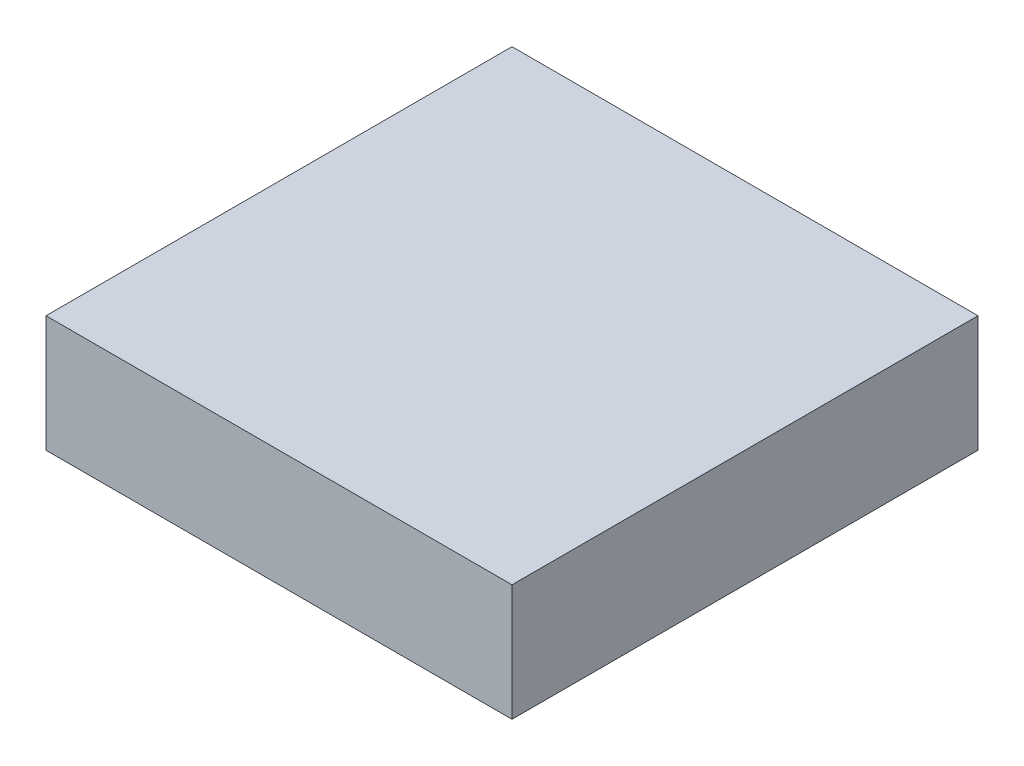
ISO-10303-21;
HEADER;
FILE_DESCRIPTION(('STEP AP214'),'2;1');
FILE_NAME('part.step','',(''),(''),'','','');
FILE_SCHEMA(('AUTOMOTIVE_DESIGN { 1 0 10303 214 1 1 1 1 }'));
ENDSEC;
DATA;
#1=APPLICATION_CONTEXT('core data for automotive mechanical design processes');
#2=APPLICATION_PROTOCOL_DEFINITION('international standard','automotive_design',2000,#1);
#3=PRODUCT_CONTEXT('',#1,'mechanical');
#4=PRODUCT('Part','Part','',(#3));
#5=PRODUCT_RELATED_PRODUCT_CATEGORY('part','',(#4));
#6=PRODUCT_DEFINITION_FORMATION('','',#4);
#7=PRODUCT_DEFINITION_CONTEXT('part definition',#1,'design');
#8=PRODUCT_DEFINITION('design','',#6,#7);
#9=PRODUCT_DEFINITION_SHAPE('','',#8);
#10=(LENGTH_UNIT() NAMED_UNIT(*) SI_UNIT(.MILLI.,.METRE.));
#11=(NAMED_UNIT(*) PLANE_ANGLE_UNIT() SI_UNIT($,.RADIAN.));
#12=(NAMED_UNIT(*) SI_UNIT($,.STERADIAN.) SOLID_ANGLE_UNIT());
#13=UNCERTAINTY_MEASURE_WITH_UNIT(LENGTH_MEASURE(1.E-05),#10,'distance_accuracy_value','');
#14=(GEOMETRIC_REPRESENTATION_CONTEXT(3) GLOBAL_UNCERTAINTY_ASSIGNED_CONTEXT((#13)) GLOBAL_UNIT_ASSIGNED_CONTEXT((#10,
#11,#12)) REPRESENTATION_CONTEXT('',''));
#15=CARTESIAN_POINT('',(0.,0.,0.));
#16=DIRECTION('',(0.,0.,1.));
#17=DIRECTION('',(1.,0.,0.));
#18=AXIS2_PLACEMENT_3D('',#15,#16,#17);
#19=CARTESIAN_POINT('',(-6096.,-3048.,-6096.));
#20=DIRECTION('',(-1.,0.,0.));
#21=DIRECTION('',(0.,0.,1.));
#22=AXIS2_PLACEMENT_3D('',#19,#20,#21);
#23=PLANE('',#22);
#24=DIRECTION('',(0.,0.,1.));
#25=VECTOR('',#24,1.);
#26=CARTESIAN_POINT('',(-6096.,0.,-6096.));
#27=LINE('',#26,#25);
#28=CARTESIAN_POINT('',(-6096.,0.,-6096.));
#29=VERTEX_POINT('',#28);
#30=CARTESIAN_POINT('',(-6096.,0.,6096.));
#31=VERTEX_POINT('',#30);
#32=EDGE_CURVE('E101',#29,#31,#27,.T.);
#33=ORIENTED_EDGE('',*,*,#32,.F.);
#34=DIRECTION('',(0.,1.,0.));
#35=VECTOR('',#34,1.);
#36=CARTESIAN_POINT('',(-6096.,-3048.,-6096.));
#37=LINE('',#36,#35);
#38=CARTESIAN_POINT('',(-6096.,-3048.,-6096.));
#39=VERTEX_POINT('',#38);
#40=EDGE_CURVE('E11',#39,#29,#37,.T.);
#41=ORIENTED_EDGE('',*,*,#40,.F.);
#42=DIRECTION('',(0.,0.,1.));
#43=VECTOR('',#42,1.);
#44=CARTESIAN_POINT('',(-6096.,-3048.,-6096.));
#45=LINE('',#44,#43);
#46=CARTESIAN_POINT('',(-6096.,-3048.,6096.));
#47=VERTEX_POINT('',#46);
#48=EDGE_CURVE('E95',#39,#47,#45,.T.);
#49=ORIENTED_EDGE('',*,*,#48,.T.);
#50=DIRECTION('',(0.,1.,0.));
#51=VECTOR('',#50,1.);
#52=CARTESIAN_POINT('',(-6096.,-3048.,6096.));
#53=LINE('',#52,#51);
#54=EDGE_CURVE('E40',#47,#31,#53,.T.);
#55=ORIENTED_EDGE('',*,*,#54,.T.);
#56=EDGE_LOOP('',(#33,#41,#49,#55));
#57=FACE_BOUND('',#56,.T.);
#58=ADVANCED_FACE('F37',(#57),#23,.T.);
#59=CARTESIAN_POINT('',(-6096.,-3048.,-6096.));
#60=DIRECTION('',(0.,0.,-1.));
#61=DIRECTION('',(-1.,0.,0.));
#62=AXIS2_PLACEMENT_3D('',#59,#60,#61);
#63=PLANE('',#62);
#64=DIRECTION('',(-1.,0.,0.));
#65=VECTOR('',#64,1.);
#66=CARTESIAN_POINT('',(-6096.,0.,-6096.));
#67=LINE('',#66,#65);
#68=CARTESIAN_POINT('',(6096.,0.,-6096.));
#69=VERTEX_POINT('',#68);
#70=EDGE_CURVE('E97',#69,#29,#67,.T.);
#71=ORIENTED_EDGE('',*,*,#70,.F.);
#72=DIRECTION('',(0.,1.,0.));
#73=VECTOR('',#72,1.);
#74=CARTESIAN_POINT('',(6096.,-3048.,-6096.));
#75=LINE('',#74,#73);
#76=CARTESIAN_POINT('',(6096.,-3048.,-6096.));
#77=VERTEX_POINT('',#76);
#78=EDGE_CURVE('E46',#77,#69,#75,.T.);
#79=ORIENTED_EDGE('',*,*,#78,.F.);
#80=DIRECTION('',(-1.,0.,0.));
#81=VECTOR('',#80,1.);
#82=CARTESIAN_POINT('',(-6096.,-3048.,-6096.));
#83=LINE('',#82,#81);
#84=EDGE_CURVE('E92',#77,#39,#83,.T.);
#85=ORIENTED_EDGE('',*,*,#84,.T.);
#86=ORIENTED_EDGE('',*,*,#40,.T.);
#87=EDGE_LOOP('',(#71,#79,#85,#86));
#88=FACE_BOUND('',#87,.T.);
#89=ADVANCED_FACE('F111',(#88),#63,.T.);
#90=CARTESIAN_POINT('',(6096.,-3048.,-6096.));
#91=DIRECTION('',(1.,0.,0.));
#92=DIRECTION('',(0.,0.,-1.));
#93=AXIS2_PLACEMENT_3D('',#90,#91,#92);
#94=PLANE('',#93);
#95=DIRECTION('',(0.,0.,-1.));
#96=VECTOR('',#95,1.);
#97=CARTESIAN_POINT('',(6096.,0.,-6096.));
#98=LINE('',#97,#96);
#99=CARTESIAN_POINT('',(6096.,0.,6096.));
#100=VERTEX_POINT('',#99);
#101=EDGE_CURVE('E87',#100,#69,#98,.T.);
#102=ORIENTED_EDGE('',*,*,#101,.F.);
#103=DIRECTION('',(0.,1.,0.));
#104=VECTOR('',#103,1.);
#105=CARTESIAN_POINT('',(6096.,-3048.,6096.));
#106=LINE('',#105,#104);
#107=CARTESIAN_POINT('',(6096.,-3048.,6096.));
#108=VERTEX_POINT('',#107);
#109=EDGE_CURVE('E82',#108,#100,#106,.T.);
#110=ORIENTED_EDGE('',*,*,#109,.F.);
#111=DIRECTION('',(0.,0.,-1.));
#112=VECTOR('',#111,1.);
#113=CARTESIAN_POINT('',(6096.,-3048.,-6096.));
#114=LINE('',#113,#112);
#115=EDGE_CURVE('E85',#108,#77,#114,.T.);
#116=ORIENTED_EDGE('',*,*,#115,.T.);
#117=ORIENTED_EDGE('',*,*,#78,.T.);
#118=EDGE_LOOP('',(#102,#110,#116,#117));
#119=FACE_BOUND('',#118,.T.);
#120=ADVANCED_FACE('F84',(#119),#94,.T.);
#121=CARTESIAN_POINT('',(-6096.,-3048.,6096.));
#122=DIRECTION('',(0.,0.,1.));
#123=DIRECTION('',(1.,0.,0.));
#124=AXIS2_PLACEMENT_3D('',#121,#122,#123);
#125=PLANE('',#124);
#126=DIRECTION('',(1.,0.,0.));
#127=VECTOR('',#126,1.);
#128=CARTESIAN_POINT('',(-6096.,0.,6096.));
#129=LINE('',#128,#127);
#130=EDGE_CURVE('E104',#31,#100,#129,.T.);
#131=ORIENTED_EDGE('',*,*,#130,.F.);
#132=ORIENTED_EDGE('',*,*,#54,.F.);
#133=DIRECTION('',(1.,0.,0.));
#134=VECTOR('',#133,1.);
#135=CARTESIAN_POINT('',(-6096.,-3048.,6096.));
#136=LINE('',#135,#134);
#137=EDGE_CURVE('E91',#47,#108,#136,.T.);
#138=ORIENTED_EDGE('',*,*,#137,.T.);
#139=ORIENTED_EDGE('',*,*,#109,.T.);
#140=EDGE_LOOP('',(#131,#132,#138,#139));
#141=FACE_BOUND('',#140,.T.);
#142=ADVANCED_FACE('F94',(#141),#125,.T.);
#143=CARTESIAN_POINT('',(0.,-3048.,0.));
#144=DIRECTION('',(0.,1.,0.));
#145=DIRECTION('',(0.,0.,1.));
#146=AXIS2_PLACEMENT_3D('',#143,#144,#145);
#147=PLANE('',#146);
#148=ORIENTED_EDGE('',*,*,#48,.F.);
#149=ORIENTED_EDGE('',*,*,#84,.F.);
#150=ORIENTED_EDGE('',*,*,#115,.F.);
#151=ORIENTED_EDGE('',*,*,#137,.F.);
#152=EDGE_LOOP('',(#148,#149,#150,#151));
#153=FACE_BOUND('',#152,.T.);
#154=ADVANCED_FACE('F90',(#153),#147,.F.);
#155=CARTESIAN_POINT('',(0.,0.,0.));
#156=DIRECTION('',(0.,1.,0.));
#157=DIRECTION('',(0.,0.,1.));
#158=AXIS2_PLACEMENT_3D('',#155,#156,#157);
#159=PLANE('',#158);
#160=ORIENTED_EDGE('',*,*,#32,.T.);
#161=ORIENTED_EDGE('',*,*,#130,.T.);
#162=ORIENTED_EDGE('',*,*,#101,.T.);
#163=ORIENTED_EDGE('',*,*,#70,.T.);
#164=EDGE_LOOP('',(#160,#161,#162,#163));
#165=FACE_BOUND('',#164,.T.);
#166=ADVANCED_FACE('F110',(#165),#159,.T.);
#167=CLOSED_SHELL('',(#58,#89,#120,#142,#154,#166));
#168=MANIFOLD_SOLID_BREP('B2',#167);
#169=ADVANCED_BREP_SHAPE_REPRESENTATION('',(#18,#168),#14);
#170=SHAPE_DEFINITION_REPRESENTATION(#9,#169);
ENDSEC;
END-ISO-10303-21;
